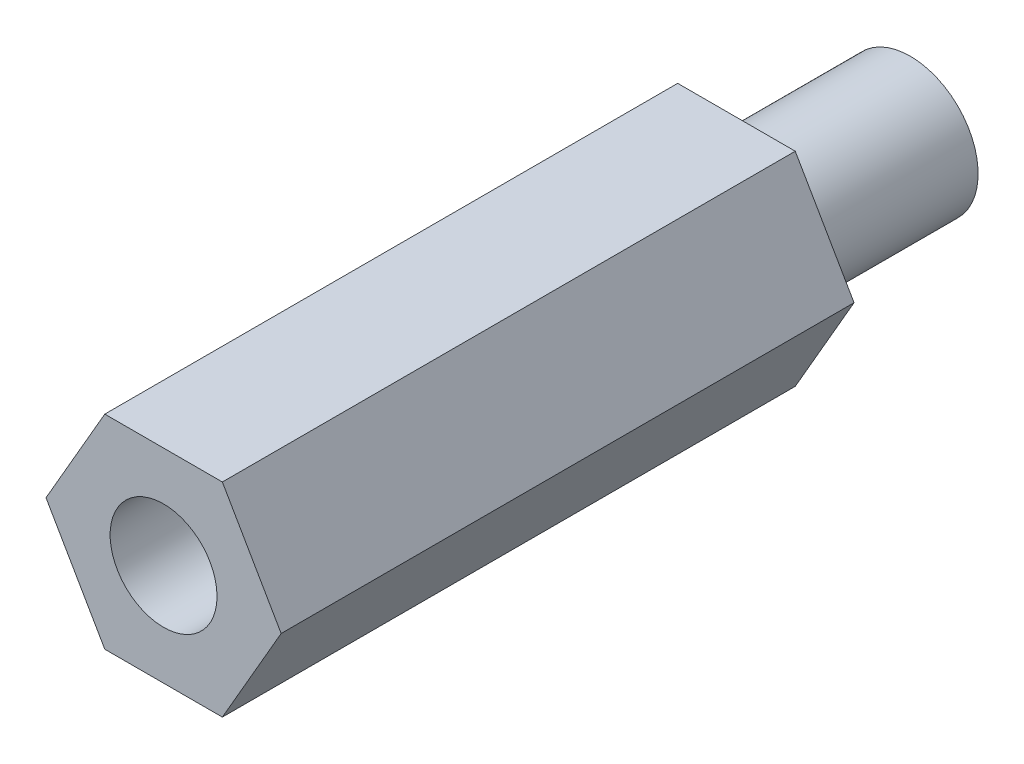
ISO-10303-21;
HEADER;
FILE_DESCRIPTION(('STEP AP214'),'2;1');
FILE_NAME('part.step','',(''),(''),'','','');
FILE_SCHEMA(('AUTOMOTIVE_DESIGN { 1 0 10303 214 1 1 1 1 }'));
ENDSEC;
DATA;
#1=APPLICATION_CONTEXT('core data for automotive mechanical design processes');
#2=APPLICATION_PROTOCOL_DEFINITION('international standard','automotive_design',2000,#1);
#3=PRODUCT_CONTEXT('',#1,'mechanical');
#4=PRODUCT('Part','Part','',(#3));
#5=PRODUCT_RELATED_PRODUCT_CATEGORY('part','',(#4));
#6=PRODUCT_DEFINITION_FORMATION('','',#4);
#7=PRODUCT_DEFINITION_CONTEXT('part definition',#1,'design');
#8=PRODUCT_DEFINITION('design','',#6,#7);
#9=PRODUCT_DEFINITION_SHAPE('','',#8);
#10=(LENGTH_UNIT() NAMED_UNIT(*) SI_UNIT(.MILLI.,.METRE.));
#11=(NAMED_UNIT(*) PLANE_ANGLE_UNIT() SI_UNIT($,.RADIAN.));
#12=(NAMED_UNIT(*) SI_UNIT($,.STERADIAN.) SOLID_ANGLE_UNIT());
#13=UNCERTAINTY_MEASURE_WITH_UNIT(LENGTH_MEASURE(1.E-05),#10,'distance_accuracy_value','');
#14=(GEOMETRIC_REPRESENTATION_CONTEXT(3) GLOBAL_UNCERTAINTY_ASSIGNED_CONTEXT((#13)) GLOBAL_UNIT_ASSIGNED_CONTEXT((#10,
#11,#12)) REPRESENTATION_CONTEXT('',''));
#15=CARTESIAN_POINT('',(0.,0.,0.));
#16=DIRECTION('',(0.,0.,1.));
#17=DIRECTION('',(1.,0.,0.));
#18=AXIS2_PLACEMENT_3D('',#15,#16,#17);
#19=CARTESIAN_POINT('',(-2.74963065701559,-4.7625,34.925));
#20=DIRECTION('',(0.,1.,0.));
#21=DIRECTION('',(-1.,0.,0.));
#22=AXIS2_PLACEMENT_3D('',#19,#20,#21);
#23=PLANE('',#22);
#24=DIRECTION('',(-1.,0.,0.));
#25=VECTOR('',#24,1.);
#26=CARTESIAN_POINT('',(-2.74963065701559,-4.7625,8.128));
#27=LINE('',#26,#25);
#28=CARTESIAN_POINT('',(2.74963065701559,-4.7625,8.128));
#29=VERTEX_POINT('',#28);
#30=CARTESIAN_POINT('',(-2.74963065701559,-4.7625,8.128));
#31=VERTEX_POINT('',#30);
#32=EDGE_CURVE('E47',#29,#31,#27,.T.);
#33=ORIENTED_EDGE('',*,*,#32,.F.);
#34=DIRECTION('',(0.,0.,-1.));
#35=VECTOR('',#34,1.);
#36=CARTESIAN_POINT('',(2.74963065701559,-4.7625,34.925));
#37=LINE('',#36,#35);
#38=CARTESIAN_POINT('',(2.74963065701559,-4.7625,34.925));
#39=VERTEX_POINT('',#38);
#40=EDGE_CURVE('E41',#39,#29,#37,.T.);
#41=ORIENTED_EDGE('',*,*,#40,.F.);
#42=DIRECTION('',(1.,0.,0.));
#43=VECTOR('',#42,1.);
#44=CARTESIAN_POINT('',(-2.74963065701559,-4.7625,34.925));
#45=LINE('',#44,#43);
#46=CARTESIAN_POINT('',(-2.74963065701559,-4.7625,34.925));
#47=VERTEX_POINT('',#46);
#48=EDGE_CURVE('E123',#47,#39,#45,.T.);
#49=ORIENTED_EDGE('',*,*,#48,.F.);
#50=DIRECTION('',(0.,0.,-1.));
#51=VECTOR('',#50,1.);
#52=CARTESIAN_POINT('',(-2.74963065701559,-4.7625,34.925));
#53=LINE('',#52,#51);
#54=EDGE_CURVE('E102',#47,#31,#53,.T.);
#55=ORIENTED_EDGE('',*,*,#54,.T.);
#56=EDGE_LOOP('',(#33,#41,#49,#55));
#57=FACE_BOUND('',#56,.T.);
#58=ADVANCED_FACE('F34',(#57),#23,.F.);
#59=CARTESIAN_POINT('',(2.74963065701559,-4.7625,34.925));
#60=DIRECTION('',(-0.866025403784439,0.5,0.));
#61=DIRECTION('',(-0.5,-0.866025403784439,0.));
#62=AXIS2_PLACEMENT_3D('',#59,#60,#61);
#63=PLANE('',#62);
#64=DIRECTION('',(-0.5,-0.866025403784439,0.));
#65=VECTOR('',#64,1.);
#66=CARTESIAN_POINT('',(2.74963065701559,-4.7625,8.128));
#67=LINE('',#66,#65);
#68=CARTESIAN_POINT('',(5.49926131403119,0.,8.128));
#69=VERTEX_POINT('',#68);
#70=EDGE_CURVE('E119',#69,#29,#67,.T.);
#71=ORIENTED_EDGE('',*,*,#70,.F.);
#72=DIRECTION('',(0.,0.,-1.));
#73=VECTOR('',#72,1.);
#74=CARTESIAN_POINT('',(5.49926131403119,0.,34.925));
#75=LINE('',#74,#73);
#76=CARTESIAN_POINT('',(5.49926131403119,0.,34.925));
#77=VERTEX_POINT('',#76);
#78=EDGE_CURVE('E111',#77,#69,#75,.T.);
#79=ORIENTED_EDGE('',*,*,#78,.F.);
#80=DIRECTION('',(0.5,0.866025403784439,0.));
#81=VECTOR('',#80,1.);
#82=CARTESIAN_POINT('',(2.74963065701559,-4.7625,34.925));
#83=LINE('',#82,#81);
#84=EDGE_CURVE('E120',#39,#77,#83,.T.);
#85=ORIENTED_EDGE('',*,*,#84,.F.);
#86=ORIENTED_EDGE('',*,*,#40,.T.);
#87=EDGE_LOOP('',(#71,#79,#85,#86));
#88=FACE_BOUND('',#87,.T.);
#89=ADVANCED_FACE('F117',(#88),#63,.F.);
#90=CARTESIAN_POINT('',(5.49926131403119,0.,34.925));
#91=DIRECTION('',(-0.866025403784439,-0.5,0.));
#92=DIRECTION('',(0.5,-0.866025403784439,0.));
#93=AXIS2_PLACEMENT_3D('',#90,#91,#92);
#94=PLANE('',#93);
#95=DIRECTION('',(0.5,-0.866025403784439,0.));
#96=VECTOR('',#95,1.);
#97=CARTESIAN_POINT('',(5.49926131403119,0.,8.128));
#98=LINE('',#97,#96);
#99=CARTESIAN_POINT('',(2.74963065701559,4.7625,8.128));
#100=VERTEX_POINT('',#99);
#101=EDGE_CURVE('E129',#100,#69,#98,.T.);
#102=ORIENTED_EDGE('',*,*,#101,.F.);
#103=DIRECTION('',(0.,0.,-1.));
#104=VECTOR('',#103,1.);
#105=CARTESIAN_POINT('',(2.74963065701559,4.7625,34.925));
#106=LINE('',#105,#104);
#107=CARTESIAN_POINT('',(2.74963065701559,4.7625,34.925));
#108=VERTEX_POINT('',#107);
#109=EDGE_CURVE('E104',#108,#100,#106,.T.);
#110=ORIENTED_EDGE('',*,*,#109,.F.);
#111=DIRECTION('',(-0.5,0.866025403784439,0.));
#112=VECTOR('',#111,1.);
#113=CARTESIAN_POINT('',(5.49926131403119,0.,34.925));
#114=LINE('',#113,#112);
#115=EDGE_CURVE('E137',#77,#108,#114,.T.);
#116=ORIENTED_EDGE('',*,*,#115,.F.);
#117=ORIENTED_EDGE('',*,*,#78,.T.);
#118=EDGE_LOOP('',(#102,#110,#116,#117));
#119=FACE_BOUND('',#118,.T.);
#120=ADVANCED_FACE('F176',(#119),#94,.F.);
#121=CARTESIAN_POINT('',(2.74963065701559,4.7625,34.925));
#122=DIRECTION('',(0.,-1.,0.));
#123=DIRECTION('',(0.,0.,-1.));
#124=AXIS2_PLACEMENT_3D('',#121,#122,#123);
#125=PLANE('',#124);
#126=DIRECTION('',(1.,0.,0.));
#127=VECTOR('',#126,1.);
#128=CARTESIAN_POINT('',(2.74963065701559,4.7625,8.128));
#129=LINE('',#128,#127);
#130=CARTESIAN_POINT('',(-2.74963065701559,4.7625,8.128));
#131=VERTEX_POINT('',#130);
#132=EDGE_CURVE('E98',#131,#100,#129,.T.);
#133=ORIENTED_EDGE('',*,*,#132,.F.);
#134=DIRECTION('',(0.,0.,-1.));
#135=VECTOR('',#134,1.);
#136=CARTESIAN_POINT('',(-2.74963065701559,4.7625,34.925));
#137=LINE('',#136,#135);
#138=CARTESIAN_POINT('',(-2.74963065701559,4.7625,34.925));
#139=VERTEX_POINT('',#138);
#140=EDGE_CURVE('E97',#139,#131,#137,.T.);
#141=ORIENTED_EDGE('',*,*,#140,.F.);
#142=DIRECTION('',(-1.,0.,0.));
#143=VECTOR('',#142,1.);
#144=CARTESIAN_POINT('',(2.74963065701559,4.7625,34.925));
#145=LINE('',#144,#143);
#146=EDGE_CURVE('E139',#108,#139,#145,.T.);
#147=ORIENTED_EDGE('',*,*,#146,.F.);
#148=ORIENTED_EDGE('',*,*,#109,.T.);
#149=EDGE_LOOP('',(#133,#141,#147,#148));
#150=FACE_BOUND('',#149,.T.);
#151=ADVANCED_FACE('F147',(#150),#125,.F.);
#152=CARTESIAN_POINT('',(-2.74963065701559,4.7625,34.925));
#153=DIRECTION('',(0.866025403784439,-0.5,0.));
#154=DIRECTION('',(0.5,0.866025403784439,0.));
#155=AXIS2_PLACEMENT_3D('',#152,#153,#154);
#156=PLANE('',#155);
#157=DIRECTION('',(0.5,0.866025403784439,0.));
#158=VECTOR('',#157,1.);
#159=CARTESIAN_POINT('',(-2.74963065701559,4.7625,8.128));
#160=LINE('',#159,#158);
#161=CARTESIAN_POINT('',(-5.49926131403118,0.,8.128));
#162=VERTEX_POINT('',#161);
#163=EDGE_CURVE('E85',#162,#131,#160,.T.);
#164=ORIENTED_EDGE('',*,*,#163,.F.);
#165=DIRECTION('',(0.,0.,-1.));
#166=VECTOR('',#165,1.);
#167=CARTESIAN_POINT('',(-5.49926131403118,0.,34.925));
#168=LINE('',#167,#166);
#169=CARTESIAN_POINT('',(-5.49926131403118,0.,34.925));
#170=VERTEX_POINT('',#169);
#171=EDGE_CURVE('E95',#170,#162,#168,.T.);
#172=ORIENTED_EDGE('',*,*,#171,.F.);
#173=DIRECTION('',(-0.5,-0.866025403784439,0.));
#174=VECTOR('',#173,1.);
#175=CARTESIAN_POINT('',(-2.74963065701559,4.7625,34.925));
#176=LINE('',#175,#174);
#177=EDGE_CURVE('E141',#139,#170,#176,.T.);
#178=ORIENTED_EDGE('',*,*,#177,.F.);
#179=ORIENTED_EDGE('',*,*,#140,.T.);
#180=EDGE_LOOP('',(#164,#172,#178,#179));
#181=FACE_BOUND('',#180,.T.);
#182=ADVANCED_FACE('F93',(#181),#156,.F.);
#183=CARTESIAN_POINT('',(-5.49926131403118,0.,34.925));
#184=DIRECTION('',(0.866025403784438,0.5,0.));
#185=DIRECTION('',(-0.5,0.866025403784438,0.));
#186=AXIS2_PLACEMENT_3D('',#183,#184,#185);
#187=PLANE('',#186);
#188=DIRECTION('',(-0.5,0.866025403784438,0.));
#189=VECTOR('',#188,1.);
#190=CARTESIAN_POINT('',(-5.49926131403118,0.,8.128));
#191=LINE('',#190,#189);
#192=EDGE_CURVE('E12',#31,#162,#191,.T.);
#193=ORIENTED_EDGE('',*,*,#192,.F.);
#194=ORIENTED_EDGE('',*,*,#54,.F.);
#195=DIRECTION('',(0.5,-0.866025403784438,0.));
#196=VECTOR('',#195,1.);
#197=CARTESIAN_POINT('',(-5.49926131403118,0.,34.925));
#198=LINE('',#197,#196);
#199=EDGE_CURVE('E55',#170,#47,#198,.T.);
#200=ORIENTED_EDGE('',*,*,#199,.F.);
#201=ORIENTED_EDGE('',*,*,#171,.T.);
#202=EDGE_LOOP('',(#193,#194,#200,#201));
#203=FACE_BOUND('',#202,.T.);
#204=ADVANCED_FACE('F101',(#203),#187,.F.);
#205=CARTESIAN_POINT('',(0.,0.,34.925));
#206=DIRECTION('',(0.,0.,1.));
#207=DIRECTION('',(1.,0.,0.));
#208=AXIS2_PLACEMENT_3D('',#205,#206,#207);
#209=PLANE('',#208);
#210=CARTESIAN_POINT('',(0.,0.,34.925));
#211=DIRECTION('',(0.,0.,1.));
#212=DIRECTION('',(1.,0.,0.));
#213=AXIS2_PLACEMENT_3D('',#210,#211,#212);
#214=CIRCLE('',#213,2.5);
#215=CARTESIAN_POINT('',(2.5,0.,34.925));
#216=VERTEX_POINT('',#215);
#217=EDGE_CURVE('E124',#216,#216,#214,.T.);
#218=ORIENTED_EDGE('',*,*,#217,.F.);
#219=EDGE_LOOP('',(#218));
#220=FACE_BOUND('',#219,.T.);
#221=ORIENTED_EDGE('',*,*,#48,.T.);
#222=ORIENTED_EDGE('',*,*,#84,.T.);
#223=ORIENTED_EDGE('',*,*,#115,.T.);
#224=ORIENTED_EDGE('',*,*,#146,.T.);
#225=ORIENTED_EDGE('',*,*,#177,.T.);
#226=ORIENTED_EDGE('',*,*,#199,.T.);
#227=EDGE_LOOP('',(#221,#222,#223,#224,#225,#226));
#228=FACE_BOUND('',#227,.T.);
#229=ADVANCED_FACE('F142',(#220,#228),#209,.T.);
#230=CARTESIAN_POINT('',(0.,0.,25.4));
#231=DIRECTION('',(0.,0.,1.));
#232=DIRECTION('',(1.,0.,0.));
#233=AXIS2_PLACEMENT_3D('',#230,#231,#232);
#234=CYLINDRICAL_SURFACE('',#233,2.5);
#235=CARTESIAN_POINT('',(0.,0.,25.4));
#236=DIRECTION('',(0.,0.,1.));
#237=DIRECTION('',(1.,0.,0.));
#238=AXIS2_PLACEMENT_3D('',#235,#236,#237);
#239=CIRCLE('',#238,2.5);
#240=CARTESIAN_POINT('',(2.5,0.,25.4));
#241=VERTEX_POINT('',#240);
#242=EDGE_CURVE('E127',#241,#241,#239,.T.);
#243=ORIENTED_EDGE('',*,*,#242,.F.);
#244=EDGE_LOOP('',(#243));
#245=FACE_BOUND('',#244,.T.);
#246=ORIENTED_EDGE('',*,*,#217,.T.);
#247=EDGE_LOOP('',(#246));
#248=FACE_BOUND('',#247,.T.);
#249=ADVANCED_FACE('F169',(#245,#248),#234,.F.);
#250=CARTESIAN_POINT('',(0.,0.,25.4));
#251=DIRECTION('',(0.,0.,1.));
#252=DIRECTION('',(1.,0.,0.));
#253=AXIS2_PLACEMENT_3D('',#250,#251,#252);
#254=PLANE('',#253);
#255=ORIENTED_EDGE('',*,*,#242,.T.);
#256=EDGE_LOOP('',(#255));
#257=FACE_BOUND('',#256,.T.);
#258=ADVANCED_FACE('F161',(#257),#254,.T.);
#259=CARTESIAN_POINT('',(0.,0.,8.128));
#260=DIRECTION('',(0.,0.,-1.));
#261=DIRECTION('',(-1.,0.,0.));
#262=AXIS2_PLACEMENT_3D('',#259,#260,#261);
#263=PLANE('',#262);
#264=CARTESIAN_POINT('',(0.,0.,8.128));
#265=DIRECTION('',(0.,0.,-1.));
#266=DIRECTION('',(-1.,0.,0.));
#267=AXIS2_PLACEMENT_3D('',#264,#265,#266);
#268=CIRCLE('',#267,3.175);
#269=CARTESIAN_POINT('',(-3.175,0.,8.128));
#270=VERTEX_POINT('',#269);
#271=EDGE_CURVE('E99',#270,#270,#268,.T.);
#272=ORIENTED_EDGE('',*,*,#271,.F.);
#273=EDGE_LOOP('',(#272));
#274=FACE_BOUND('',#273,.T.);
#275=ORIENTED_EDGE('',*,*,#32,.T.);
#276=ORIENTED_EDGE('',*,*,#192,.T.);
#277=ORIENTED_EDGE('',*,*,#163,.T.);
#278=ORIENTED_EDGE('',*,*,#132,.T.);
#279=ORIENTED_EDGE('',*,*,#101,.T.);
#280=ORIENTED_EDGE('',*,*,#70,.T.);
#281=EDGE_LOOP('',(#275,#276,#277,#278,#279,#280));
#282=FACE_BOUND('',#281,.T.);
#283=ADVANCED_FACE('F84',(#274,#282),#263,.T.);
#284=CARTESIAN_POINT('',(0.,0.,8.128));
#285=DIRECTION('',(0.,0.,-1.));
#286=DIRECTION('',(-1.,0.,0.));
#287=AXIS2_PLACEMENT_3D('',#284,#285,#286);
#288=CYLINDRICAL_SURFACE('',#287,3.175);
#289=ORIENTED_EDGE('',*,*,#271,.T.);
#290=EDGE_LOOP('',(#289));
#291=FACE_BOUND('',#290,.T.);
#292=CARTESIAN_POINT('',(0.,0.,0.));
#293=DIRECTION('',(0.,0.,-1.));
#294=DIRECTION('',(-1.,0.,0.));
#295=AXIS2_PLACEMENT_3D('',#292,#293,#294);
#296=CIRCLE('',#295,3.175);
#297=CARTESIAN_POINT('',(-3.175,0.,0.));
#298=VERTEX_POINT('',#297);
#299=EDGE_CURVE('E151',#298,#298,#296,.T.);
#300=ORIENTED_EDGE('',*,*,#299,.F.);
#301=EDGE_LOOP('',(#300));
#302=FACE_BOUND('',#301,.T.);
#303=ADVANCED_FACE('F157',(#291,#302),#288,.T.);
#304=CARTESIAN_POINT('',(0.,0.,0.));
#305=DIRECTION('',(0.,0.,1.));
#306=DIRECTION('',(1.,0.,0.));
#307=AXIS2_PLACEMENT_3D('',#304,#305,#306);
#308=PLANE('',#307);
#309=ORIENTED_EDGE('',*,*,#299,.T.);
#310=EDGE_LOOP('',(#309));
#311=FACE_BOUND('',#310,.T.);
#312=ADVANCED_FACE('F167',(#311),#308,.F.);
#313=CLOSED_SHELL('',(#58,#89,#120,#151,#182,#204,#229,#249,#258,#283,#303,#312));
#314=MANIFOLD_SOLID_BREP('B2',#313);
#315=ADVANCED_BREP_SHAPE_REPRESENTATION('',(#18,#314),#14);
#316=SHAPE_DEFINITION_REPRESENTATION(#9,#315);
ENDSEC;
END-ISO-10303-21;
